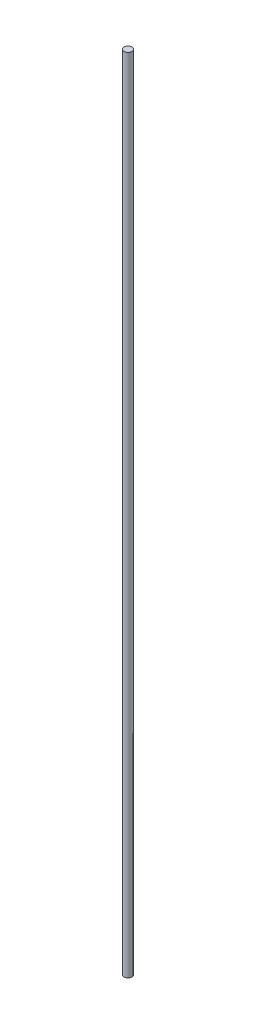
ISO-10303-21;
HEADER;
FILE_DESCRIPTION(('STEP AP214'),'2;1');
FILE_NAME('part.step','',(''),(''),'','','');
FILE_SCHEMA(('AUTOMOTIVE_DESIGN { 1 0 10303 214 1 1 1 1 }'));
ENDSEC;
DATA;
#1=APPLICATION_CONTEXT('core data for automotive mechanical design processes');
#2=APPLICATION_PROTOCOL_DEFINITION('international standard','automotive_design',2000,#1);
#3=PRODUCT_CONTEXT('',#1,'mechanical');
#4=PRODUCT('Part','Part','',(#3));
#5=PRODUCT_RELATED_PRODUCT_CATEGORY('part','',(#4));
#6=PRODUCT_DEFINITION_FORMATION('','',#4);
#7=PRODUCT_DEFINITION_CONTEXT('part definition',#1,'design');
#8=PRODUCT_DEFINITION('design','',#6,#7);
#9=PRODUCT_DEFINITION_SHAPE('','',#8);
#10=(LENGTH_UNIT() NAMED_UNIT(*) SI_UNIT(.MILLI.,.METRE.));
#11=(NAMED_UNIT(*) PLANE_ANGLE_UNIT() SI_UNIT($,.RADIAN.));
#12=(NAMED_UNIT(*) SI_UNIT($,.STERADIAN.) SOLID_ANGLE_UNIT());
#13=UNCERTAINTY_MEASURE_WITH_UNIT(LENGTH_MEASURE(1.E-05),#10,'distance_accuracy_value','');
#14=(GEOMETRIC_REPRESENTATION_CONTEXT(3) GLOBAL_UNCERTAINTY_ASSIGNED_CONTEXT((#13)) GLOBAL_UNIT_ASSIGNED_CONTEXT((#10,
#11,#12)) REPRESENTATION_CONTEXT('',''));
#15=CARTESIAN_POINT('',(0.,0.,0.));
#16=DIRECTION('',(0.,0.,1.));
#17=DIRECTION('',(1.,0.,0.));
#18=AXIS2_PLACEMENT_3D('',#15,#16,#17);
#19=CARTESIAN_POINT('',(0.,194.,0.));
#20=DIRECTION('',(0.,-1.,0.));
#21=DIRECTION('',(0.,0.,-1.));
#22=AXIS2_PLACEMENT_3D('',#19,#20,#21);
#23=CYLINDRICAL_SURFACE('',#22,0.95);
#24=CARTESIAN_POINT('',(0.,194.,0.));
#25=DIRECTION('',(0.,1.,0.));
#26=DIRECTION('',(0.,0.,1.));
#27=AXIS2_PLACEMENT_3D('',#24,#25,#26);
#28=CIRCLE('',#27,0.95);
#29=CARTESIAN_POINT('',(0.,194.,0.95));
#30=VERTEX_POINT('',#29);
#31=EDGE_CURVE('E10',#30,#30,#28,.T.);
#32=ORIENTED_EDGE('',*,*,#31,.F.);
#33=EDGE_LOOP('',(#32));
#34=FACE_BOUND('',#33,.T.);
#35=CARTESIAN_POINT('',(0.,0.,0.));
#36=DIRECTION('',(0.,1.,0.));
#37=DIRECTION('',(0.,0.,1.));
#38=AXIS2_PLACEMENT_3D('',#35,#36,#37);
#39=CIRCLE('',#38,0.95);
#40=CARTESIAN_POINT('',(0.,0.,0.95));
#41=VERTEX_POINT('',#40);
#42=EDGE_CURVE('E36',#41,#41,#39,.T.);
#43=ORIENTED_EDGE('',*,*,#42,.T.);
#44=EDGE_LOOP('',(#43));
#45=FACE_BOUND('',#44,.T.);
#46=ADVANCED_FACE('F33',(#34,#45),#23,.T.);
#47=CARTESIAN_POINT('',(0.,194.,0.));
#48=DIRECTION('',(0.,1.,0.));
#49=DIRECTION('',(0.,0.,1.));
#50=AXIS2_PLACEMENT_3D('',#47,#48,#49);
#51=PLANE('',#50);
#52=ORIENTED_EDGE('',*,*,#31,.T.);
#53=EDGE_LOOP('',(#52));
#54=FACE_BOUND('',#53,.T.);
#55=ADVANCED_FACE('F48',(#54),#51,.T.);
#56=CARTESIAN_POINT('',(0.,0.,0.));
#57=DIRECTION('',(0.,1.,0.));
#58=DIRECTION('',(0.,0.,1.));
#59=AXIS2_PLACEMENT_3D('',#56,#57,#58);
#60=PLANE('',#59);
#61=ORIENTED_EDGE('',*,*,#42,.F.);
#62=EDGE_LOOP('',(#61));
#63=FACE_BOUND('',#62,.T.);
#64=ADVANCED_FACE('F46',(#63),#60,.F.);
#65=CLOSED_SHELL('',(#46,#55,#64));
#66=MANIFOLD_SOLID_BREP('B2',#65);
#67=ADVANCED_BREP_SHAPE_REPRESENTATION('',(#18,#66),#14);
#68=SHAPE_DEFINITION_REPRESENTATION(#9,#67);
ENDSEC;
END-ISO-10303-21;
